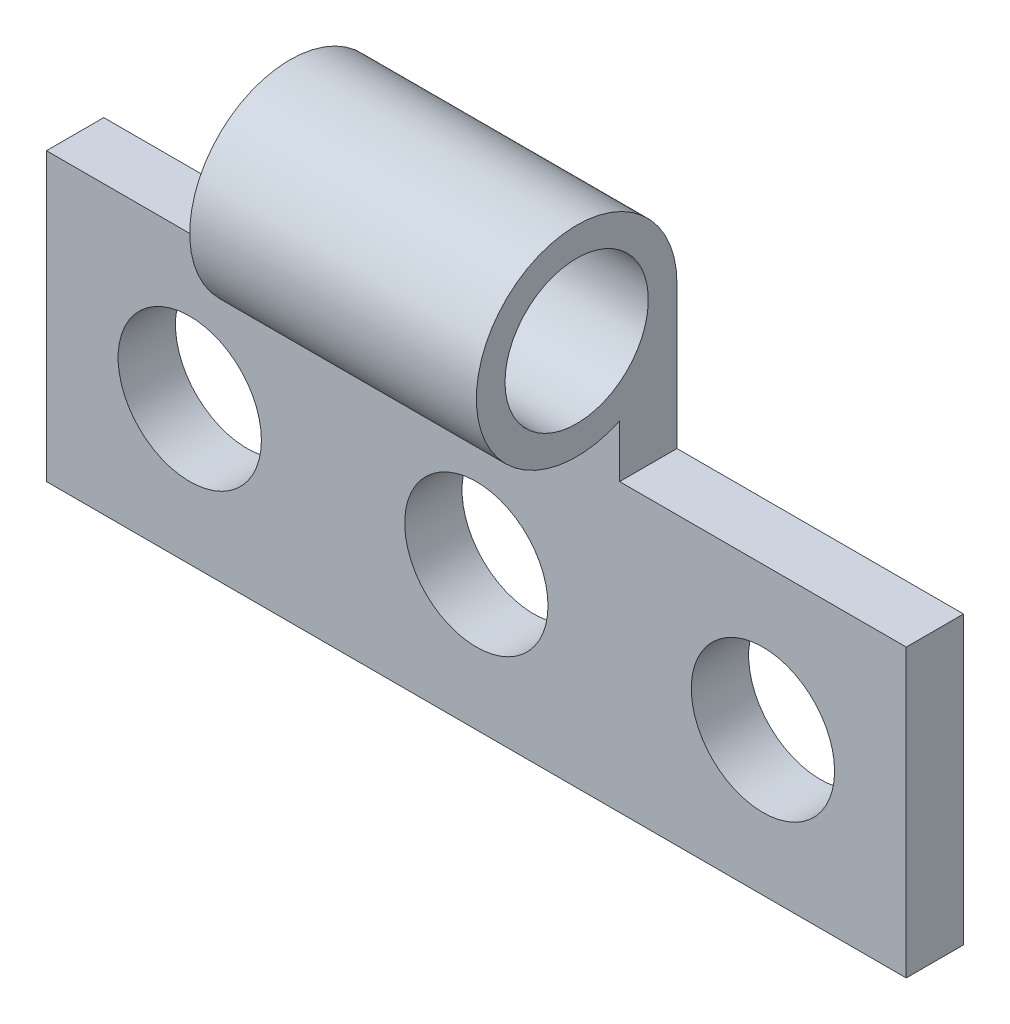
ISO-10303-21;
HEADER;
FILE_DESCRIPTION(('STEP AP214'),'2;1');
FILE_NAME('part.step','',(''),(''),'','','');
FILE_SCHEMA(('AUTOMOTIVE_DESIGN { 1 0 10303 214 1 1 1 1 }'));
ENDSEC;
DATA;
#1=APPLICATION_CONTEXT('core data for automotive mechanical design processes');
#2=APPLICATION_PROTOCOL_DEFINITION('international standard','automotive_design',2000,#1);
#3=PRODUCT_CONTEXT('',#1,'mechanical');
#4=PRODUCT('Part','Part','',(#3));
#5=PRODUCT_RELATED_PRODUCT_CATEGORY('part','',(#4));
#6=PRODUCT_DEFINITION_FORMATION('','',#4);
#7=PRODUCT_DEFINITION_CONTEXT('part definition',#1,'design');
#8=PRODUCT_DEFINITION('design','',#6,#7);
#9=PRODUCT_DEFINITION_SHAPE('','',#8);
#10=(LENGTH_UNIT() NAMED_UNIT(*) SI_UNIT(.MILLI.,.METRE.));
#11=(NAMED_UNIT(*) PLANE_ANGLE_UNIT() SI_UNIT($,.RADIAN.));
#12=(NAMED_UNIT(*) SI_UNIT($,.STERADIAN.) SOLID_ANGLE_UNIT());
#13=UNCERTAINTY_MEASURE_WITH_UNIT(LENGTH_MEASURE(1.E-05),#10,'distance_accuracy_value','');
#14=(GEOMETRIC_REPRESENTATION_CONTEXT(3) GLOBAL_UNCERTAINTY_ASSIGNED_CONTEXT((#13)) GLOBAL_UNIT_ASSIGNED_CONTEXT((#10,
#11,#12)) REPRESENTATION_CONTEXT('',''));
#15=CARTESIAN_POINT('',(0.,0.,0.));
#16=DIRECTION('',(0.,0.,1.));
#17=DIRECTION('',(1.,0.,0.));
#18=AXIS2_PLACEMENT_3D('',#15,#16,#17);
#19=CARTESIAN_POINT('',(-15.,5.,2.));
#20=DIRECTION('',(0.,-1.,0.));
#21=DIRECTION('',(0.,0.,-1.));
#22=AXIS2_PLACEMENT_3D('',#19,#20,#21);
#23=PLANE('',#22);
#24=DIRECTION('',(0.,0.,1.));
#25=VECTOR('',#24,1.);
#26=CARTESIAN_POINT('',(-5.,5.,0.));
#27=LINE('',#26,#25);
#28=CARTESIAN_POINT('',(-5.,5.,0.));
#29=VERTEX_POINT('',#28);
#30=CARTESIAN_POINT('',(-5.,5.,2.));
#31=VERTEX_POINT('',#30);
#32=EDGE_CURVE('E64',#29,#31,#27,.T.);
#33=ORIENTED_EDGE('',*,*,#32,.F.);
#34=DIRECTION('',(-1.,0.,0.));
#35=VECTOR('',#34,1.);
#36=CARTESIAN_POINT('',(-15.,5.,0.));
#37=LINE('',#36,#35);
#38=CARTESIAN_POINT('',(-15.,5.,0.));
#39=VERTEX_POINT('',#38);
#40=EDGE_CURVE('E159',#29,#39,#37,.T.);
#41=ORIENTED_EDGE('',*,*,#40,.T.);
#42=DIRECTION('',(0.,0.,-1.));
#43=VECTOR('',#42,1.);
#44=CARTESIAN_POINT('',(-15.,5.,2.));
#45=LINE('',#44,#43);
#46=CARTESIAN_POINT('',(-15.,5.,2.));
#47=VERTEX_POINT('',#46);
#48=EDGE_CURVE('E48',#47,#39,#45,.T.);
#49=ORIENTED_EDGE('',*,*,#48,.F.);
#50=DIRECTION('',(-1.,0.,0.));
#51=VECTOR('',#50,1.);
#52=CARTESIAN_POINT('',(-15.,5.,2.));
#53=LINE('',#52,#51);
#54=EDGE_CURVE('E149',#31,#47,#53,.T.);
#55=ORIENTED_EDGE('',*,*,#54,.F.);
#56=EDGE_LOOP('',(#33,#41,#49,#55));
#57=FACE_BOUND('',#56,.T.);
#58=ADVANCED_FACE('F39',(#57),#23,.F.);
#59=CARTESIAN_POINT('',(15.,5.,2.));
#60=DIRECTION('',(-1.,0.,0.));
#61=DIRECTION('',(0.,0.,1.));
#62=AXIS2_PLACEMENT_3D('',#59,#60,#61);
#63=PLANE('',#62);
#64=DIRECTION('',(0.,1.,0.));
#65=VECTOR('',#64,1.);
#66=CARTESIAN_POINT('',(15.,5.,0.));
#67=LINE('',#66,#65);
#68=CARTESIAN_POINT('',(15.,-5.,0.));
#69=VERTEX_POINT('',#68);
#70=CARTESIAN_POINT('',(15.,5.,0.));
#71=VERTEX_POINT('',#70);
#72=EDGE_CURVE('E117',#69,#71,#67,.T.);
#73=ORIENTED_EDGE('',*,*,#72,.T.);
#74=DIRECTION('',(0.,0.,-1.));
#75=VECTOR('',#74,1.);
#76=CARTESIAN_POINT('',(15.,5.,2.));
#77=LINE('',#76,#75);
#78=CARTESIAN_POINT('',(15.,5.,2.));
#79=VERTEX_POINT('',#78);
#80=EDGE_CURVE('E11',#79,#71,#77,.T.);
#81=ORIENTED_EDGE('',*,*,#80,.F.);
#82=DIRECTION('',(0.,1.,0.));
#83=VECTOR('',#82,1.);
#84=CARTESIAN_POINT('',(15.,5.,2.));
#85=LINE('',#84,#83);
#86=CARTESIAN_POINT('',(15.,-5.,2.));
#87=VERTEX_POINT('',#86);
#88=EDGE_CURVE('E147',#87,#79,#85,.T.);
#89=ORIENTED_EDGE('',*,*,#88,.F.);
#90=DIRECTION('',(0.,0.,-1.));
#91=VECTOR('',#90,1.);
#92=CARTESIAN_POINT('',(15.,-5.,2.));
#93=LINE('',#92,#91);
#94=EDGE_CURVE('E156',#87,#69,#93,.T.);
#95=ORIENTED_EDGE('',*,*,#94,.T.);
#96=EDGE_LOOP('',(#73,#81,#89,#95));
#97=FACE_BOUND('',#96,.T.);
#98=ADVANCED_FACE('F41',(#97),#63,.F.);
#99=CARTESIAN_POINT('',(4.99999999999999,5.,0.));
#100=VERTEX_POINT('',#99);
#101=EDGE_CURVE('E160',#71,#100,#37,.T.);
#102=ORIENTED_EDGE('',*,*,#101,.T.);
#103=DIRECTION('',(0.,0.,1.));
#104=VECTOR('',#103,1.);
#105=CARTESIAN_POINT('',(5.,5.,0.));
#106=LINE('',#105,#104);
#107=CARTESIAN_POINT('',(4.99999999999999,5.,2.));
#108=VERTEX_POINT('',#107);
#109=EDGE_CURVE('E56',#100,#108,#106,.T.);
#110=ORIENTED_EDGE('',*,*,#109,.T.);
#111=EDGE_CURVE('E129',#79,#108,#53,.T.);
#112=ORIENTED_EDGE('',*,*,#111,.F.);
#113=ORIENTED_EDGE('',*,*,#80,.T.);
#114=EDGE_LOOP('',(#102,#110,#112,#113));
#115=FACE_BOUND('',#114,.T.);
#116=ADVANCED_FACE('F236',(#115),#23,.F.);
#117=CARTESIAN_POINT('',(-15.,5.,2.));
#118=DIRECTION('',(1.,0.,0.));
#119=DIRECTION('',(0.,1.,0.));
#120=AXIS2_PLACEMENT_3D('',#117,#118,#119);
#121=PLANE('',#120);
#122=DIRECTION('',(0.,-1.,0.));
#123=VECTOR('',#122,1.);
#124=CARTESIAN_POINT('',(-15.,5.,0.));
#125=LINE('',#124,#123);
#126=CARTESIAN_POINT('',(-15.,-5.,0.));
#127=VERTEX_POINT('',#126);
#128=EDGE_CURVE('E162',#39,#127,#125,.T.);
#129=ORIENTED_EDGE('',*,*,#128,.T.);
#130=DIRECTION('',(0.,0.,-1.));
#131=VECTOR('',#130,1.);
#132=CARTESIAN_POINT('',(-15.,-5.,2.));
#133=LINE('',#132,#131);
#134=CARTESIAN_POINT('',(-15.,-5.,2.));
#135=VERTEX_POINT('',#134);
#136=EDGE_CURVE('E167',#135,#127,#133,.T.);
#137=ORIENTED_EDGE('',*,*,#136,.F.);
#138=DIRECTION('',(0.,-1.,0.));
#139=VECTOR('',#138,1.);
#140=CARTESIAN_POINT('',(-15.,5.,2.));
#141=LINE('',#140,#139);
#142=EDGE_CURVE('E152',#47,#135,#141,.T.);
#143=ORIENTED_EDGE('',*,*,#142,.F.);
#144=ORIENTED_EDGE('',*,*,#48,.T.);
#145=EDGE_LOOP('',(#129,#137,#143,#144));
#146=FACE_BOUND('',#145,.T.);
#147=ADVANCED_FACE('F230',(#146),#121,.F.);
#148=CARTESIAN_POINT('',(-15.,-5.,2.));
#149=DIRECTION('',(0.,1.,0.));
#150=DIRECTION('',(0.,0.,1.));
#151=AXIS2_PLACEMENT_3D('',#148,#149,#150);
#152=PLANE('',#151);
#153=DIRECTION('',(1.,0.,0.));
#154=VECTOR('',#153,1.);
#155=CARTESIAN_POINT('',(-15.,-5.,0.));
#156=LINE('',#155,#154);
#157=EDGE_CURVE('E150',#127,#69,#156,.T.);
#158=ORIENTED_EDGE('',*,*,#157,.T.);
#159=ORIENTED_EDGE('',*,*,#94,.F.);
#160=DIRECTION('',(1.,0.,0.));
#161=VECTOR('',#160,1.);
#162=CARTESIAN_POINT('',(-15.,-5.,2.));
#163=LINE('',#162,#161);
#164=EDGE_CURVE('E154',#135,#87,#163,.T.);
#165=ORIENTED_EDGE('',*,*,#164,.F.);
#166=ORIENTED_EDGE('',*,*,#136,.T.);
#167=EDGE_LOOP('',(#158,#159,#165,#166));
#168=FACE_BOUND('',#167,.T.);
#169=ADVANCED_FACE('F201',(#168),#152,.F.);
#170=CARTESIAN_POINT('',(0.,0.,2.));
#171=DIRECTION('',(0.,0.,1.));
#172=DIRECTION('',(1.,0.,0.));
#173=AXIS2_PLACEMENT_3D('',#170,#171,#172);
#174=PLANE('',#173);
#175=CARTESIAN_POINT('',(-9.99999999999999,0.,2.));
#176=DIRECTION('',(0.,0.,1.));
#177=DIRECTION('',(1.,0.,0.));
#178=AXIS2_PLACEMENT_3D('',#175,#176,#177);
#179=CIRCLE('',#178,2.5);
#180=CARTESIAN_POINT('',(-7.49999999999999,0.,2.));
#181=VERTEX_POINT('',#180);
#182=EDGE_CURVE('E175',#181,#181,#179,.T.);
#183=ORIENTED_EDGE('',*,*,#182,.F.);
#184=EDGE_LOOP('',(#183));
#185=FACE_BOUND('',#184,.T.);
#186=CARTESIAN_POINT('',(0.,0.,2.));
#187=DIRECTION('',(0.,0.,1.));
#188=DIRECTION('',(1.,0.,0.));
#189=AXIS2_PLACEMENT_3D('',#186,#187,#188);
#190=CIRCLE('',#189,2.5);
#191=CARTESIAN_POINT('',(2.50000000000001,0.,2.));
#192=VERTEX_POINT('',#191);
#193=EDGE_CURVE('E189',#192,#192,#190,.T.);
#194=ORIENTED_EDGE('',*,*,#193,.F.);
#195=EDGE_LOOP('',(#194));
#196=FACE_BOUND('',#195,.T.);
#197=CARTESIAN_POINT('',(10.,0.,2.));
#198=DIRECTION('',(0.,0.,1.));
#199=DIRECTION('',(1.,0.,0.));
#200=AXIS2_PLACEMENT_3D('',#197,#198,#199);
#201=CIRCLE('',#200,2.5);
#202=CARTESIAN_POINT('',(12.5,0.,2.));
#203=VERTEX_POINT('',#202);
#204=EDGE_CURVE('E186',#203,#203,#201,.T.);
#205=ORIENTED_EDGE('',*,*,#204,.F.);
#206=EDGE_LOOP('',(#205));
#207=FACE_BOUND('',#206,.T.);
#208=ORIENTED_EDGE('',*,*,#88,.T.);
#209=ORIENTED_EDGE('',*,*,#111,.T.);
#210=DIRECTION('',(0.,1.,0.));
#211=VECTOR('',#210,1.);
#212=CARTESIAN_POINT('',(5.,5.,2.));
#213=LINE('',#212,#211);
#214=CARTESIAN_POINT('',(5.,6.83772233983162,2.));
#215=VERTEX_POINT('',#214);
#216=EDGE_CURVE('E123',#108,#215,#213,.T.);
#217=ORIENTED_EDGE('',*,*,#216,.T.);
#218=DIRECTION('',(1.,0.,0.));
#219=VECTOR('',#218,1.);
#220=CARTESIAN_POINT('',(-5.,6.83772233983162,2.));
#221=LINE('',#220,#219);
#222=CARTESIAN_POINT('',(-5.,6.83772233983162,2.));
#223=VERTEX_POINT('',#222);
#224=EDGE_CURVE('E107',#223,#215,#221,.T.);
#225=ORIENTED_EDGE('',*,*,#224,.F.);
#226=DIRECTION('',(0.,1.,0.));
#227=VECTOR('',#226,1.);
#228=CARTESIAN_POINT('',(-5.,5.,2.));
#229=LINE('',#228,#227);
#230=EDGE_CURVE('E140',#31,#223,#229,.T.);
#231=ORIENTED_EDGE('',*,*,#230,.F.);
#232=ORIENTED_EDGE('',*,*,#54,.T.);
#233=ORIENTED_EDGE('',*,*,#142,.T.);
#234=ORIENTED_EDGE('',*,*,#164,.T.);
#235=EDGE_LOOP('',(#208,#209,#217,#225,#231,#232,#233,#234));
#236=FACE_BOUND('',#235,.T.);
#237=ADVANCED_FACE('F128',(#185,#196,#207,#236),#174,.T.);
#238=CARTESIAN_POINT('',(0.,0.,0.));
#239=DIRECTION('',(0.,0.,1.));
#240=DIRECTION('',(1.,0.,0.));
#241=AXIS2_PLACEMENT_3D('',#238,#239,#240);
#242=PLANE('',#241);
#243=CARTESIAN_POINT('',(-9.99999999999999,0.,0.));
#244=DIRECTION('',(0.,0.,1.));
#245=DIRECTION('',(1.,0.,0.));
#246=AXIS2_PLACEMENT_3D('',#243,#244,#245);
#247=CIRCLE('',#246,2.5);
#248=CARTESIAN_POINT('',(-7.49999999999999,0.,0.));
#249=VERTEX_POINT('',#248);
#250=EDGE_CURVE('E43',#249,#249,#247,.T.);
#251=ORIENTED_EDGE('',*,*,#250,.T.);
#252=EDGE_LOOP('',(#251));
#253=FACE_BOUND('',#252,.T.);
#254=CARTESIAN_POINT('',(0.,0.,0.));
#255=DIRECTION('',(0.,0.,1.));
#256=DIRECTION('',(1.,0.,0.));
#257=AXIS2_PLACEMENT_3D('',#254,#255,#256);
#258=CIRCLE('',#257,2.5);
#259=CARTESIAN_POINT('',(2.50000000000001,0.,0.));
#260=VERTEX_POINT('',#259);
#261=EDGE_CURVE('E174',#260,#260,#258,.T.);
#262=ORIENTED_EDGE('',*,*,#261,.T.);
#263=EDGE_LOOP('',(#262));
#264=FACE_BOUND('',#263,.T.);
#265=CARTESIAN_POINT('',(10.,0.,0.));
#266=DIRECTION('',(0.,0.,1.));
#267=DIRECTION('',(1.,0.,0.));
#268=AXIS2_PLACEMENT_3D('',#265,#266,#267);
#269=CIRCLE('',#268,2.5);
#270=CARTESIAN_POINT('',(12.5,0.,0.));
#271=VERTEX_POINT('',#270);
#272=EDGE_CURVE('E172',#271,#271,#269,.T.);
#273=ORIENTED_EDGE('',*,*,#272,.T.);
#274=EDGE_LOOP('',(#273));
#275=FACE_BOUND('',#274,.T.);
#276=ORIENTED_EDGE('',*,*,#72,.F.);
#277=ORIENTED_EDGE('',*,*,#157,.F.);
#278=ORIENTED_EDGE('',*,*,#128,.F.);
#279=ORIENTED_EDGE('',*,*,#40,.F.);
#280=DIRECTION('',(0.,-1.,0.));
#281=VECTOR('',#280,1.);
#282=CARTESIAN_POINT('',(-5.,5.,0.));
#283=LINE('',#282,#281);
#284=CARTESIAN_POINT('',(-5.,10.,0.));
#285=VERTEX_POINT('',#284);
#286=EDGE_CURVE('E143',#285,#29,#283,.T.);
#287=ORIENTED_EDGE('',*,*,#286,.F.);
#288=DIRECTION('',(1.,0.,0.));
#289=VECTOR('',#288,1.);
#290=CARTESIAN_POINT('',(-5.,10.,0.));
#291=LINE('',#290,#289);
#292=CARTESIAN_POINT('',(5.,10.,0.));
#293=VERTEX_POINT('',#292);
#294=EDGE_CURVE('E118',#285,#293,#291,.T.);
#295=ORIENTED_EDGE('',*,*,#294,.T.);
#296=DIRECTION('',(0.,-1.,0.));
#297=VECTOR('',#296,1.);
#298=CARTESIAN_POINT('',(5.,5.,0.));
#299=LINE('',#298,#297);
#300=EDGE_CURVE('E125',#293,#100,#299,.T.);
#301=ORIENTED_EDGE('',*,*,#300,.T.);
#302=ORIENTED_EDGE('',*,*,#101,.F.);
#303=EDGE_LOOP('',(#276,#277,#278,#279,#287,#295,#301,#302));
#304=FACE_BOUND('',#303,.T.);
#305=ADVANCED_FACE('F200',(#253,#264,#275,#304),#242,.F.);
#306=CARTESIAN_POINT('',(-5.,10.,3.5));
#307=DIRECTION('',(-1.,0.,0.));
#308=DIRECTION('',(0.,0.,1.));
#309=AXIS2_PLACEMENT_3D('',#306,#307,#308);
#310=PLANE('',#309);
#311=ORIENTED_EDGE('',*,*,#32,.T.);
#312=ORIENTED_EDGE('',*,*,#230,.T.);
#313=CARTESIAN_POINT('',(-5.,10.,3.5));
#314=DIRECTION('',(-1.,0.,0.));
#315=DIRECTION('',(0.,0.,1.));
#316=AXIS2_PLACEMENT_3D('',#313,#314,#315);
#317=CIRCLE('',#316,3.5);
#318=EDGE_CURVE('E113',#223,#285,#317,.T.);
#319=ORIENTED_EDGE('',*,*,#318,.T.);
#320=ORIENTED_EDGE('',*,*,#286,.T.);
#321=EDGE_LOOP('',(#311,#312,#319,#320));
#322=FACE_BOUND('',#321,.T.);
#323=CARTESIAN_POINT('',(-5.,10.,3.5));
#324=DIRECTION('',(-1.,0.,0.));
#325=DIRECTION('',(0.,0.,1.));
#326=AXIS2_PLACEMENT_3D('',#323,#324,#325);
#327=CIRCLE('',#326,2.5);
#328=CARTESIAN_POINT('',(-5.,10.,6.));
#329=VERTEX_POINT('',#328);
#330=EDGE_CURVE('E136',#329,#329,#327,.T.);
#331=ORIENTED_EDGE('',*,*,#330,.F.);
#332=EDGE_LOOP('',(#331));
#333=FACE_BOUND('',#332,.T.);
#334=ADVANCED_FACE('F216',(#322,#333),#310,.T.);
#335=CARTESIAN_POINT('',(-5.,10.,3.5));
#336=DIRECTION('',(1.,0.,0.));
#337=DIRECTION('',(0.,0.,-1.));
#338=AXIS2_PLACEMENT_3D('',#335,#336,#337);
#339=CYLINDRICAL_SURFACE('',#338,3.5);
#340=ORIENTED_EDGE('',*,*,#224,.T.);
#341=CARTESIAN_POINT('',(5.,10.,3.5));
#342=DIRECTION('',(-1.,0.,0.));
#343=DIRECTION('',(0.,0.,1.));
#344=AXIS2_PLACEMENT_3D('',#341,#342,#343);
#345=CIRCLE('',#344,3.5);
#346=EDGE_CURVE('E111',#215,#293,#345,.T.);
#347=ORIENTED_EDGE('',*,*,#346,.T.);
#348=ORIENTED_EDGE('',*,*,#294,.F.);
#349=ORIENTED_EDGE('',*,*,#318,.F.);
#350=EDGE_LOOP('',(#340,#347,#348,#349));
#351=FACE_BOUND('',#350,.T.);
#352=ADVANCED_FACE('F109',(#351),#339,.T.);
#353=CARTESIAN_POINT('',(-5.,10.,3.5));
#354=DIRECTION('',(1.,0.,0.));
#355=DIRECTION('',(0.,0.,-1.));
#356=AXIS2_PLACEMENT_3D('',#353,#354,#355);
#357=CYLINDRICAL_SURFACE('',#356,2.5);
#358=ORIENTED_EDGE('',*,*,#330,.T.);
#359=EDGE_LOOP('',(#358));
#360=FACE_BOUND('',#359,.T.);
#361=CARTESIAN_POINT('',(5.,10.,3.5));
#362=DIRECTION('',(-1.,0.,0.));
#363=DIRECTION('',(0.,0.,1.));
#364=AXIS2_PLACEMENT_3D('',#361,#362,#363);
#365=CIRCLE('',#364,2.5);
#366=CARTESIAN_POINT('',(5.,10.,6.));
#367=VERTEX_POINT('',#366);
#368=EDGE_CURVE('E131',#367,#367,#365,.T.);
#369=ORIENTED_EDGE('',*,*,#368,.F.);
#370=EDGE_LOOP('',(#369));
#371=FACE_BOUND('',#370,.T.);
#372=ADVANCED_FACE('F252',(#360,#371),#357,.F.);
#373=CARTESIAN_POINT('',(5.,10.,3.5));
#374=DIRECTION('',(-1.,0.,0.));
#375=DIRECTION('',(0.,0.,1.));
#376=AXIS2_PLACEMENT_3D('',#373,#374,#375);
#377=PLANE('',#376);
#378=ORIENTED_EDGE('',*,*,#368,.T.);
#379=EDGE_LOOP('',(#378));
#380=FACE_BOUND('',#379,.T.);
#381=ORIENTED_EDGE('',*,*,#109,.F.);
#382=ORIENTED_EDGE('',*,*,#300,.F.);
#383=ORIENTED_EDGE('',*,*,#346,.F.);
#384=ORIENTED_EDGE('',*,*,#216,.F.);
#385=EDGE_LOOP('',(#381,#382,#383,#384));
#386=FACE_BOUND('',#385,.T.);
#387=ADVANCED_FACE('F122',(#380,#386),#377,.F.);
#388=CARTESIAN_POINT('',(10.,0.,-8.));
#389=DIRECTION('',(0.,0.,1.));
#390=DIRECTION('',(1.,0.,0.));
#391=AXIS2_PLACEMENT_3D('',#388,#389,#390);
#392=CYLINDRICAL_SURFACE('',#391,2.5);
#393=ORIENTED_EDGE('',*,*,#204,.T.);
#394=EDGE_LOOP('',(#393));
#395=FACE_BOUND('',#394,.T.);
#396=ORIENTED_EDGE('',*,*,#272,.F.);
#397=EDGE_LOOP('',(#396));
#398=FACE_BOUND('',#397,.T.);
#399=ADVANCED_FACE('F207',(#395,#398),#392,.F.);
#400=CARTESIAN_POINT('',(0.,0.,-8.));
#401=DIRECTION('',(0.,0.,1.));
#402=DIRECTION('',(1.,0.,0.));
#403=AXIS2_PLACEMENT_3D('',#400,#401,#402);
#404=CYLINDRICAL_SURFACE('',#403,2.5);
#405=ORIENTED_EDGE('',*,*,#193,.T.);
#406=EDGE_LOOP('',(#405));
#407=FACE_BOUND('',#406,.T.);
#408=ORIENTED_EDGE('',*,*,#261,.F.);
#409=EDGE_LOOP('',(#408));
#410=FACE_BOUND('',#409,.T.);
#411=ADVANCED_FACE('F210',(#407,#410),#404,.F.);
#412=CARTESIAN_POINT('',(-9.99999999999999,0.,-8.));
#413=DIRECTION('',(0.,0.,1.));
#414=DIRECTION('',(1.,0.,0.));
#415=AXIS2_PLACEMENT_3D('',#412,#413,#414);
#416=CYLINDRICAL_SURFACE('',#415,2.5);
#417=ORIENTED_EDGE('',*,*,#182,.T.);
#418=EDGE_LOOP('',(#417));
#419=FACE_BOUND('',#418,.T.);
#420=ORIENTED_EDGE('',*,*,#250,.F.);
#421=EDGE_LOOP('',(#420));
#422=FACE_BOUND('',#421,.T.);
#423=ADVANCED_FACE('F195',(#419,#422),#416,.F.);
#424=CLOSED_SHELL('',(#58,#98,#116,#147,#169,#237,#305,#334,#352,#372,#387,#399,#411,#423));
#425=MANIFOLD_SOLID_BREP('B2',#424);
#426=ADVANCED_BREP_SHAPE_REPRESENTATION('',(#18,#425),#14);
#427=SHAPE_DEFINITION_REPRESENTATION(#9,#426);
ENDSEC;
END-ISO-10303-21;
